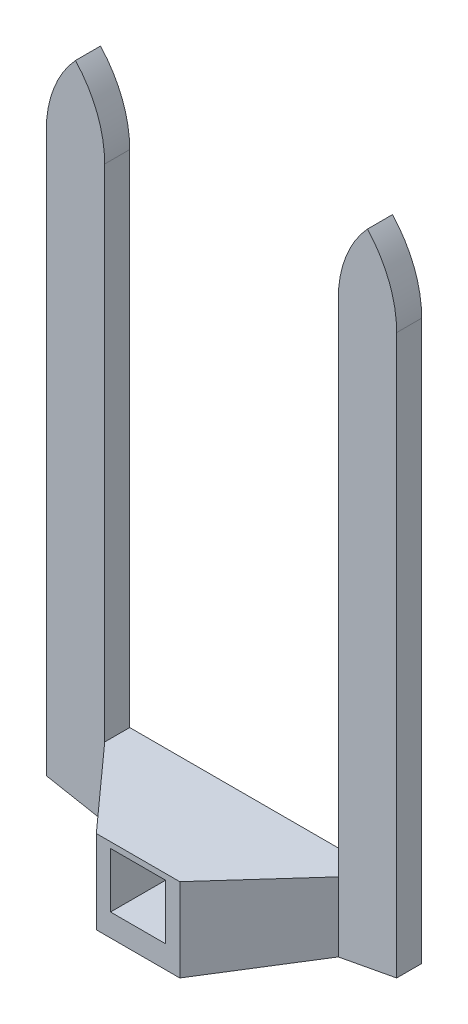
ISO-10303-21;
HEADER;
FILE_DESCRIPTION(('STEP AP214'),'2;1');
FILE_NAME('part.step','',(''),(''),'','','');
FILE_SCHEMA(('AUTOMOTIVE_DESIGN { 1 0 10303 214 1 1 1 1 }'));
ENDSEC;
DATA;
#1=APPLICATION_CONTEXT('core data for automotive mechanical design processes');
#2=APPLICATION_PROTOCOL_DEFINITION('international standard','automotive_design',2000,#1);
#3=PRODUCT_CONTEXT('',#1,'mechanical');
#4=PRODUCT('Part','Part','',(#3));
#5=PRODUCT_RELATED_PRODUCT_CATEGORY('part','',(#4));
#6=PRODUCT_DEFINITION_FORMATION('','',#4);
#7=PRODUCT_DEFINITION_CONTEXT('part definition',#1,'design');
#8=PRODUCT_DEFINITION('design','',#6,#7);
#9=PRODUCT_DEFINITION_SHAPE('','',#8);
#10=(LENGTH_UNIT() NAMED_UNIT(*) SI_UNIT(.MILLI.,.METRE.));
#11=(NAMED_UNIT(*) PLANE_ANGLE_UNIT() SI_UNIT($,.RADIAN.));
#12=(NAMED_UNIT(*) SI_UNIT($,.STERADIAN.) SOLID_ANGLE_UNIT());
#13=UNCERTAINTY_MEASURE_WITH_UNIT(LENGTH_MEASURE(1.E-05),#10,'distance_accuracy_value','');
#14=(GEOMETRIC_REPRESENTATION_CONTEXT(3) GLOBAL_UNCERTAINTY_ASSIGNED_CONTEXT((#13)) GLOBAL_UNIT_ASSIGNED_CONTEXT((#10,
#11,#12)) REPRESENTATION_CONTEXT('',''));
#15=CARTESIAN_POINT('',(0.,0.,0.));
#16=DIRECTION('',(0.,0.,1.));
#17=DIRECTION('',(1.,0.,0.));
#18=AXIS2_PLACEMENT_3D('',#15,#16,#17);
#19=CARTESIAN_POINT('',(27.3214285714285,338.403728499216,46.6064318781235));
#20=DIRECTION('',(0.,0.,-1.));
#21=DIRECTION('',(-1.,0.,0.));
#22=AXIS2_PLACEMENT_3D('',#19,#20,#21);
#23=PLANE('',#22);
#24=CARTESIAN_POINT('',(27.3214285714285,348.403728499216,46.6064318781235));
#25=DIRECTION('',(0.,0.,1.));
#26=DIRECTION('',(1.,0.,0.));
#27=AXIS2_PLACEMENT_3D('',#24,#25,#26);
#28=CIRCLE('',#27,13.3214285714285);
#29=CARTESIAN_POINT('',(14.,348.403728499216,46.6064318781235));
#30=VERTEX_POINT('',#29);
#31=CARTESIAN_POINT('',(17.5,357.403728499216,46.6064318781235));
#32=VERTEX_POINT('',#31);
#33=EDGE_CURVE('E205',#30,#32,#28,.F.);
#34=ORIENTED_EDGE('',*,*,#33,.F.);
#35=DIRECTION('',(0.,1.,0.));
#36=VECTOR('',#35,1.);
#37=CARTESIAN_POINT('',(14.,288.403728499216,46.6064318781235));
#38=LINE('',#37,#36);
#39=CARTESIAN_POINT('',(14.0000000000001,288.403728499216,46.6064318781235));
#40=VERTEX_POINT('',#39);
#41=EDGE_CURVE('E269',#40,#30,#38,.T.);
#42=ORIENTED_EDGE('',*,*,#41,.F.);
#43=DIRECTION('',(0.,-1.,0.));
#44=VECTOR('',#43,1.);
#45=CARTESIAN_POINT('',(14.0000000000001,338.403728499216,46.6064318781235));
#46=LINE('',#45,#44);
#47=CARTESIAN_POINT('',(14.0000000000001,280.091228499217,46.6064318781235));
#48=VERTEX_POINT('',#47);
#49=EDGE_CURVE('E246',#48,#40,#46,.F.);
#50=ORIENTED_EDGE('',*,*,#49,.F.);
#51=DIRECTION('',(-0.982872186934322,-0.184288535050185,0.));
#52=VECTOR('',#51,1.);
#53=CARTESIAN_POINT('',(21.,281.403728499217,46.6064318781235));
#54=LINE('',#53,#52);
#55=CARTESIAN_POINT('',(21.,281.403728499217,46.6064318781235));
#56=VERTEX_POINT('',#55);
#57=EDGE_CURVE('E258',#56,#48,#54,.T.);
#58=ORIENTED_EDGE('',*,*,#57,.F.);
#59=DIRECTION('',(0.,-1.,0.));
#60=VECTOR('',#59,1.);
#61=CARTESIAN_POINT('',(21.,338.403728499216,46.6064318781235));
#62=LINE('',#61,#60);
#63=CARTESIAN_POINT('',(21.,348.403728499216,46.6064318781235));
#64=VERTEX_POINT('',#63);
#65=EDGE_CURVE('E255',#64,#56,#62,.T.);
#66=ORIENTED_EDGE('',*,*,#65,.F.);
#67=CARTESIAN_POINT('',(7.67857142857152,348.403728499216,46.6064318781235));
#68=DIRECTION('',(0.,0.,1.));
#69=DIRECTION('',(1.,0.,0.));
#70=AXIS2_PLACEMENT_3D('',#67,#68,#69);
#71=CIRCLE('',#70,13.3214285714285);
#72=EDGE_CURVE('E201',#32,#64,#71,.F.);
#73=ORIENTED_EDGE('',*,*,#72,.F.);
#74=EDGE_LOOP('',(#34,#42,#50,#58,#66,#73));
#75=FACE_BOUND('',#74,.T.);
#76=ADVANCED_FACE('F34',(#75),#23,.F.);
#77=DIRECTION('',(0.,-1.,0.));
#78=VECTOR('',#77,1.);
#79=CARTESIAN_POINT('',(-14.,338.403728499216,46.6064318781235));
#80=LINE('',#79,#78);
#81=CARTESIAN_POINT('',(-14.,348.403728499216,46.6064318781235));
#82=VERTEX_POINT('',#81);
#83=CARTESIAN_POINT('',(-14.0000000000001,288.403728499216,46.6064318781235));
#84=VERTEX_POINT('',#83);
#85=EDGE_CURVE('E267',#82,#84,#80,.T.);
#86=ORIENTED_EDGE('',*,*,#85,.F.);
#87=CARTESIAN_POINT('',(-27.3214285714285,348.403728499216,46.6064318781235));
#88=DIRECTION('',(0.,0.,1.));
#89=DIRECTION('',(1.,0.,0.));
#90=AXIS2_PLACEMENT_3D('',#87,#88,#89);
#91=CIRCLE('',#90,13.3214285714285);
#92=CARTESIAN_POINT('',(-17.5,357.403728499216,46.6064318781235));
#93=VERTEX_POINT('',#92);
#94=EDGE_CURVE('E213',#82,#93,#91,.T.);
#95=ORIENTED_EDGE('',*,*,#94,.T.);
#96=CARTESIAN_POINT('',(-7.67857142857152,348.403728499216,46.6064318781235));
#97=DIRECTION('',(0.,0.,1.));
#98=DIRECTION('',(1.,0.,0.));
#99=AXIS2_PLACEMENT_3D('',#96,#97,#98);
#100=CIRCLE('',#99,13.3214285714285);
#101=CARTESIAN_POINT('',(-21.,348.403728499216,46.6064318781235));
#102=VERTEX_POINT('',#101);
#103=EDGE_CURVE('E223',#93,#102,#100,.T.);
#104=ORIENTED_EDGE('',*,*,#103,.T.);
#105=DIRECTION('',(0.,1.,0.));
#106=VECTOR('',#105,1.);
#107=CARTESIAN_POINT('',(-21.,281.403728499217,46.6064318781235));
#108=LINE('',#107,#106);
#109=CARTESIAN_POINT('',(-21.,281.403728499217,46.6064318781235));
#110=VERTEX_POINT('',#109);
#111=EDGE_CURVE('E265',#110,#102,#108,.T.);
#112=ORIENTED_EDGE('',*,*,#111,.F.);
#113=DIRECTION('',(-0.982872186934322,0.184288535050185,0.));
#114=VECTOR('',#113,1.);
#115=CARTESIAN_POINT('',(-5.,278.403728499217,46.6064318781235));
#116=LINE('',#115,#114);
#117=CARTESIAN_POINT('',(-14.0000000000001,280.091228499217,46.6064318781235));
#118=VERTEX_POINT('',#117);
#119=EDGE_CURVE('E262',#118,#110,#116,.T.);
#120=ORIENTED_EDGE('',*,*,#119,.F.);
#121=DIRECTION('',(0.,1.,0.));
#122=VECTOR('',#121,1.);
#123=CARTESIAN_POINT('',(-14.0000000000001,338.403728499216,46.6064318781235));
#124=LINE('',#123,#122);
#125=EDGE_CURVE('E241',#84,#118,#124,.F.);
#126=ORIENTED_EDGE('',*,*,#125,.F.);
#127=EDGE_LOOP('',(#86,#95,#104,#112,#120,#126));
#128=FACE_BOUND('',#127,.T.);
#129=ADVANCED_FACE('F348',(#128),#23,.F.);
#130=CARTESIAN_POINT('',(14.,288.403728499216,46.6064318781235));
#131=DIRECTION('',(-1.,0.,0.));
#132=DIRECTION('',(0.,0.,1.));
#133=AXIS2_PLACEMENT_3D('',#130,#131,#132);
#134=PLANE('',#133);
#135=DIRECTION('',(0.,1.,0.));
#136=VECTOR('',#135,1.);
#137=CARTESIAN_POINT('',(14.,288.403728499216,43.6064318781235));
#138=LINE('',#137,#136);
#139=CARTESIAN_POINT('',(14.,288.403728499216,43.6064318781235));
#140=VERTEX_POINT('',#139);
#141=CARTESIAN_POINT('',(14.,348.403728499216,43.6064318781235));
#142=VERTEX_POINT('',#141);
#143=EDGE_CURVE('E259',#140,#142,#138,.T.);
#144=ORIENTED_EDGE('',*,*,#143,.F.);
#145=DIRECTION('',(0.,0.,-1.));
#146=VECTOR('',#145,1.);
#147=CARTESIAN_POINT('',(14.,288.403728499216,46.6064318781235));
#148=LINE('',#147,#146);
#149=EDGE_CURVE('E294',#40,#140,#148,.T.);
#150=ORIENTED_EDGE('',*,*,#149,.F.);
#151=ORIENTED_EDGE('',*,*,#41,.T.);
#152=DIRECTION('',(0.,0.,1.));
#153=VECTOR('',#152,1.);
#154=CARTESIAN_POINT('',(14.,348.403728499216,43.6064318781235));
#155=LINE('',#154,#153);
#156=EDGE_CURVE('E204',#142,#30,#155,.T.);
#157=ORIENTED_EDGE('',*,*,#156,.F.);
#158=EDGE_LOOP('',(#144,#150,#151,#157));
#159=FACE_BOUND('',#158,.T.);
#160=ADVANCED_FACE('F341',(#159),#134,.T.);
#161=CARTESIAN_POINT('',(-14.,288.403728499216,46.6064318781235));
#162=DIRECTION('',(0.,1.,0.));
#163=DIRECTION('',(0.,0.,1.));
#164=AXIS2_PLACEMENT_3D('',#161,#162,#163);
#165=PLANE('',#164);
#166=DIRECTION('',(1.,0.,0.));
#167=VECTOR('',#166,1.);
#168=CARTESIAN_POINT('',(-14.,288.403728499216,43.6064318781235));
#169=LINE('',#168,#167);
#170=CARTESIAN_POINT('',(-14.,288.403728499216,43.6064318781235));
#171=VERTEX_POINT('',#170);
#172=EDGE_CURVE('E290',#171,#140,#169,.T.);
#173=ORIENTED_EDGE('',*,*,#172,.F.);
#174=DIRECTION('',(0.,0.,-1.));
#175=VECTOR('',#174,1.);
#176=CARTESIAN_POINT('',(-14.,288.403728499216,46.6064318781235));
#177=LINE('',#176,#175);
#178=EDGE_CURVE('E296',#84,#171,#177,.T.);
#179=ORIENTED_EDGE('',*,*,#178,.F.);
#180=DIRECTION('',(0.668964731622453,0.,0.743294146247164));
#181=VECTOR('',#180,1.);
#182=CARTESIAN_POINT('',(-14.,288.403728499216,46.6064318781235));
#183=LINE('',#182,#181);
#184=CARTESIAN_POINT('',(-5.,288.403728499216,56.6064318781235));
#185=VERTEX_POINT('',#184);
#186=EDGE_CURVE('E276',#185,#84,#183,.F.);
#187=ORIENTED_EDGE('',*,*,#186,.F.);
#188=DIRECTION('',(-1.,0.,0.));
#189=VECTOR('',#188,1.);
#190=CARTESIAN_POINT('',(-5.,288.403728499216,56.6064318781235));
#191=LINE('',#190,#189);
#192=CARTESIAN_POINT('',(5.,288.403728499216,56.6064318781235));
#193=VERTEX_POINT('',#192);
#194=EDGE_CURVE('E242',#193,#185,#191,.T.);
#195=ORIENTED_EDGE('',*,*,#194,.F.);
#196=DIRECTION('',(-0.668964731622453,0.,0.743294146247164));
#197=VECTOR('',#196,1.);
#198=CARTESIAN_POINT('',(5.,288.403728499216,56.6064318781235));
#199=LINE('',#198,#197);
#200=EDGE_CURVE('E254',#193,#40,#199,.F.);
#201=ORIENTED_EDGE('',*,*,#200,.T.);
#202=ORIENTED_EDGE('',*,*,#149,.T.);
#203=EDGE_LOOP('',(#173,#179,#187,#195,#201,#202));
#204=FACE_BOUND('',#203,.T.);
#205=ADVANCED_FACE('F318',(#204),#165,.T.);
#206=CARTESIAN_POINT('',(-14.,338.403728499216,46.6064318781235));
#207=DIRECTION('',(1.,0.,0.));
#208=DIRECTION('',(0.,0.,-1.));
#209=AXIS2_PLACEMENT_3D('',#206,#207,#208);
#210=PLANE('',#209);
#211=DIRECTION('',(0.,-1.,0.));
#212=VECTOR('',#211,1.);
#213=CARTESIAN_POINT('',(-14.,338.403728499216,43.6064318781235));
#214=LINE('',#213,#212);
#215=CARTESIAN_POINT('',(-14.,348.403728499216,43.6064318781235));
#216=VERTEX_POINT('',#215);
#217=EDGE_CURVE('E287',#216,#171,#214,.T.);
#218=ORIENTED_EDGE('',*,*,#217,.F.);
#219=DIRECTION('',(0.,0.,1.));
#220=VECTOR('',#219,1.);
#221=CARTESIAN_POINT('',(-14.,348.403728499216,43.6064318781235));
#222=LINE('',#221,#220);
#223=EDGE_CURVE('E226',#216,#82,#222,.T.);
#224=ORIENTED_EDGE('',*,*,#223,.T.);
#225=ORIENTED_EDGE('',*,*,#85,.T.);
#226=ORIENTED_EDGE('',*,*,#178,.T.);
#227=EDGE_LOOP('',(#218,#224,#225,#226));
#228=FACE_BOUND('',#227,.T.);
#229=ADVANCED_FACE('F374',(#228),#210,.T.);
#230=CARTESIAN_POINT('',(-21.,281.403728499217,46.6064318781235));
#231=DIRECTION('',(-1.,0.,0.));
#232=DIRECTION('',(0.,0.,1.));
#233=AXIS2_PLACEMENT_3D('',#230,#231,#232);
#234=PLANE('',#233);
#235=DIRECTION('',(0.,1.,0.));
#236=VECTOR('',#235,1.);
#237=CARTESIAN_POINT('',(-21.,281.403728499217,43.6064318781235));
#238=LINE('',#237,#236);
#239=CARTESIAN_POINT('',(-21.,281.403728499217,43.6064318781235));
#240=VERTEX_POINT('',#239);
#241=CARTESIAN_POINT('',(-21.,348.403728499216,43.6064318781235));
#242=VERTEX_POINT('',#241);
#243=EDGE_CURVE('E285',#240,#242,#238,.T.);
#244=ORIENTED_EDGE('',*,*,#243,.F.);
#245=DIRECTION('',(0.,0.,-1.));
#246=VECTOR('',#245,1.);
#247=CARTESIAN_POINT('',(-21.,281.403728499217,46.6064318781235));
#248=LINE('',#247,#246);
#249=EDGE_CURVE('E298',#110,#240,#248,.T.);
#250=ORIENTED_EDGE('',*,*,#249,.F.);
#251=ORIENTED_EDGE('',*,*,#111,.T.);
#252=DIRECTION('',(0.,0.,1.));
#253=VECTOR('',#252,1.);
#254=CARTESIAN_POINT('',(-21.,348.403728499216,43.6064318781235));
#255=LINE('',#254,#253);
#256=EDGE_CURVE('E231',#242,#102,#255,.T.);
#257=ORIENTED_EDGE('',*,*,#256,.F.);
#258=EDGE_LOOP('',(#244,#250,#251,#257));
#259=FACE_BOUND('',#258,.T.);
#260=ADVANCED_FACE('F366',(#259),#234,.T.);
#261=CARTESIAN_POINT('',(-5.,278.403728499217,46.6064318781235));
#262=DIRECTION('',(-0.184288535050185,-0.982872186934322,0.));
#263=DIRECTION('',(0.982872186934322,-0.184288535050185,0.));
#264=AXIS2_PLACEMENT_3D('',#261,#262,#263);
#265=PLANE('',#264);
#266=DIRECTION('',(-0.982872186934322,0.184288535050185,0.));
#267=VECTOR('',#266,1.);
#268=CARTESIAN_POINT('',(-5.,278.403728499217,43.6064318781235));
#269=LINE('',#268,#267);
#270=CARTESIAN_POINT('',(-5.,278.403728499217,43.6064318781235));
#271=VERTEX_POINT('',#270);
#272=EDGE_CURVE('E282',#271,#240,#269,.T.);
#273=ORIENTED_EDGE('',*,*,#272,.F.);
#274=DIRECTION('',(0.,0.,-1.));
#275=VECTOR('',#274,1.);
#276=CARTESIAN_POINT('',(-5.,278.403728499217,46.6064318781235));
#277=LINE('',#276,#275);
#278=CARTESIAN_POINT('',(-5.,278.403728499217,56.6064318781235));
#279=VERTEX_POINT('',#278);
#280=EDGE_CURVE('E300',#279,#271,#277,.T.);
#281=ORIENTED_EDGE('',*,*,#280,.F.);
#282=DIRECTION('',(-0.66376364286523,0.124455683037231,-0.737515158739138));
#283=VECTOR('',#282,1.);
#284=CARTESIAN_POINT('',(-9.89535748433019,279.321608027529,51.1671457844233));
#285=LINE('',#284,#283);
#286=EDGE_CURVE('E43',#118,#279,#285,.F.);
#287=ORIENTED_EDGE('',*,*,#286,.F.);
#288=ORIENTED_EDGE('',*,*,#119,.T.);
#289=ORIENTED_EDGE('',*,*,#249,.T.);
#290=EDGE_LOOP('',(#273,#281,#287,#288,#289));
#291=FACE_BOUND('',#290,.T.);
#292=ADVANCED_FACE('F364',(#291),#265,.T.);
#293=CARTESIAN_POINT('',(5.,278.403728499217,46.6064318781235));
#294=DIRECTION('',(0.,-1.,0.));
#295=DIRECTION('',(0.,0.,-1.));
#296=AXIS2_PLACEMENT_3D('',#293,#294,#295);
#297=PLANE('',#296);
#298=CARTESIAN_POINT('',(0.,278.403728499217,50.1064318781235));
#299=DIRECTION('',(0.,1.,0.));
#300=DIRECTION('',(0.,0.,1.));
#301=AXIS2_PLACEMENT_3D('',#298,#299,#300);
#302=CIRCLE('',#301,1.89999999999999);
#303=CARTESIAN_POINT('',(0.,278.403728499217,52.0064318781235));
#304=VERTEX_POINT('',#303);
#305=EDGE_CURVE('E234',#304,#304,#302,.T.);
#306=ORIENTED_EDGE('',*,*,#305,.T.);
#307=EDGE_LOOP('',(#306));
#308=FACE_BOUND('',#307,.T.);
#309=DIRECTION('',(-1.,0.,0.));
#310=VECTOR('',#309,1.);
#311=CARTESIAN_POINT('',(5.,278.403728499217,43.6064318781235));
#312=LINE('',#311,#310);
#313=CARTESIAN_POINT('',(5.,278.403728499217,43.6064318781235));
#314=VERTEX_POINT('',#313);
#315=EDGE_CURVE('E279',#314,#271,#312,.T.);
#316=ORIENTED_EDGE('',*,*,#315,.F.);
#317=DIRECTION('',(0.,0.,-1.));
#318=VECTOR('',#317,1.);
#319=CARTESIAN_POINT('',(5.,278.403728499217,46.6064318781235));
#320=LINE('',#319,#318);
#321=CARTESIAN_POINT('',(5.,278.403728499217,56.6064318781235));
#322=VERTEX_POINT('',#321);
#323=EDGE_CURVE('E302',#322,#314,#320,.T.);
#324=ORIENTED_EDGE('',*,*,#323,.F.);
#325=DIRECTION('',(1.,0.,0.));
#326=VECTOR('',#325,1.);
#327=CARTESIAN_POINT('',(5.,278.403728499217,56.6064318781235));
#328=LINE('',#327,#326);
#329=EDGE_CURVE('E249',#279,#322,#328,.T.);
#330=ORIENTED_EDGE('',*,*,#329,.F.);
#331=ORIENTED_EDGE('',*,*,#280,.T.);
#332=EDGE_LOOP('',(#316,#324,#330,#331));
#333=FACE_BOUND('',#332,.T.);
#334=ADVANCED_FACE('F358',(#308,#333),#297,.T.);
#335=CARTESIAN_POINT('',(21.,281.403728499217,46.6064318781235));
#336=DIRECTION('',(0.184288535050185,-0.982872186934322,0.));
#337=DIRECTION('',(0.982872186934322,0.184288535050185,0.));
#338=AXIS2_PLACEMENT_3D('',#335,#336,#337);
#339=PLANE('',#338);
#340=DIRECTION('',(-0.982872186934322,-0.184288535050185,0.));
#341=VECTOR('',#340,1.);
#342=CARTESIAN_POINT('',(21.,281.403728499217,43.6064318781235));
#343=LINE('',#342,#341);
#344=CARTESIAN_POINT('',(21.,281.403728499217,43.6064318781235));
#345=VERTEX_POINT('',#344);
#346=EDGE_CURVE('E275',#345,#314,#343,.T.);
#347=ORIENTED_EDGE('',*,*,#346,.F.);
#348=DIRECTION('',(0.,0.,-1.));
#349=VECTOR('',#348,1.);
#350=CARTESIAN_POINT('',(21.,281.403728499217,46.6064318781235));
#351=LINE('',#350,#349);
#352=EDGE_CURVE('E271',#56,#345,#351,.T.);
#353=ORIENTED_EDGE('',*,*,#352,.F.);
#354=ORIENTED_EDGE('',*,*,#57,.T.);
#355=DIRECTION('',(0.66376364286523,0.124455683037231,-0.737515158739138));
#356=VECTOR('',#355,1.);
#357=CARTESIAN_POINT('',(5.82609157548064,278.55862066962,55.6885523498117));
#358=LINE('',#357,#356);
#359=EDGE_CURVE('E11',#48,#322,#358,.F.);
#360=ORIENTED_EDGE('',*,*,#359,.T.);
#361=ORIENTED_EDGE('',*,*,#323,.T.);
#362=EDGE_LOOP('',(#347,#353,#354,#360,#361));
#363=FACE_BOUND('',#362,.T.);
#364=ADVANCED_FACE('F328',(#363),#339,.T.);
#365=CARTESIAN_POINT('',(21.,338.403728499216,46.6064318781235));
#366=DIRECTION('',(1.,0.,0.));
#367=DIRECTION('',(0.,0.,-1.));
#368=AXIS2_PLACEMENT_3D('',#365,#366,#367);
#369=PLANE('',#368);
#370=DIRECTION('',(0.,-1.,0.));
#371=VECTOR('',#370,1.);
#372=CARTESIAN_POINT('',(21.,338.403728499216,43.6064318781235));
#373=LINE('',#372,#371);
#374=CARTESIAN_POINT('',(21.,348.403728499216,43.6064318781235));
#375=VERTEX_POINT('',#374);
#376=EDGE_CURVE('E272',#375,#345,#373,.T.);
#377=ORIENTED_EDGE('',*,*,#376,.F.);
#378=DIRECTION('',(0.,0.,1.));
#379=VECTOR('',#378,1.);
#380=CARTESIAN_POINT('',(21.,348.403728499216,43.6064318781235));
#381=LINE('',#380,#379);
#382=EDGE_CURVE('E214',#375,#64,#381,.T.);
#383=ORIENTED_EDGE('',*,*,#382,.T.);
#384=ORIENTED_EDGE('',*,*,#65,.T.);
#385=ORIENTED_EDGE('',*,*,#352,.T.);
#386=EDGE_LOOP('',(#377,#383,#384,#385));
#387=FACE_BOUND('',#386,.T.);
#388=ADVANCED_FACE('F330',(#387),#369,.T.);
#389=CARTESIAN_POINT('',(27.3214285714285,338.403728499216,43.6064318781235));
#390=DIRECTION('',(0.,0.,-1.));
#391=DIRECTION('',(-1.,0.,0.));
#392=AXIS2_PLACEMENT_3D('',#389,#390,#391);
#393=PLANE('',#392);
#394=DIRECTION('',(0.,-1.,0.));
#395=VECTOR('',#394,1.);
#396=CARTESIAN_POINT('',(-3.3,287.703728499216,43.6064318781235));
#397=LINE('',#396,#395);
#398=CARTESIAN_POINT('',(-3.3,287.703728499216,43.6064318781235));
#399=VERTEX_POINT('',#398);
#400=CARTESIAN_POINT('',(-3.3,281.103728499217,43.6064318781235));
#401=VERTEX_POINT('',#400);
#402=EDGE_CURVE('E162',#399,#401,#397,.T.);
#403=ORIENTED_EDGE('',*,*,#402,.T.);
#404=DIRECTION('',(1.,0.,0.));
#405=VECTOR('',#404,1.);
#406=CARTESIAN_POINT('',(-3.3,281.103728499217,43.6064318781235));
#407=LINE('',#406,#405);
#408=CARTESIAN_POINT('',(3.3,281.103728499217,43.6064318781235));
#409=VERTEX_POINT('',#408);
#410=EDGE_CURVE('E171',#401,#409,#407,.T.);
#411=ORIENTED_EDGE('',*,*,#410,.T.);
#412=DIRECTION('',(0.,1.,0.));
#413=VECTOR('',#412,1.);
#414=CARTESIAN_POINT('',(3.3,287.703728499216,43.6064318781235));
#415=LINE('',#414,#413);
#416=CARTESIAN_POINT('',(3.3,287.703728499216,43.6064318781235));
#417=VERTEX_POINT('',#416);
#418=EDGE_CURVE('E50',#409,#417,#415,.T.);
#419=ORIENTED_EDGE('',*,*,#418,.T.);
#420=DIRECTION('',(-1.,0.,0.));
#421=VECTOR('',#420,1.);
#422=CARTESIAN_POINT('',(-3.3,287.703728499216,43.6064318781235));
#423=LINE('',#422,#421);
#424=EDGE_CURVE('E168',#417,#399,#423,.T.);
#425=ORIENTED_EDGE('',*,*,#424,.T.);
#426=EDGE_LOOP('',(#403,#411,#419,#425));
#427=FACE_BOUND('',#426,.T.);
#428=CARTESIAN_POINT('',(7.67857142857152,348.403728499216,43.6064318781235));
#429=DIRECTION('',(0.,0.,1.));
#430=DIRECTION('',(1.,0.,0.));
#431=AXIS2_PLACEMENT_3D('',#428,#429,#430);
#432=CIRCLE('',#431,13.3214285714285);
#433=CARTESIAN_POINT('',(17.5,357.403728499216,43.6064318781235));
#434=VERTEX_POINT('',#433);
#435=EDGE_CURVE('E200',#434,#375,#432,.F.);
#436=ORIENTED_EDGE('',*,*,#435,.T.);
#437=ORIENTED_EDGE('',*,*,#376,.T.);
#438=ORIENTED_EDGE('',*,*,#346,.T.);
#439=ORIENTED_EDGE('',*,*,#315,.T.);
#440=ORIENTED_EDGE('',*,*,#272,.T.);
#441=ORIENTED_EDGE('',*,*,#243,.T.);
#442=CARTESIAN_POINT('',(-7.67857142857152,348.403728499216,43.6064318781235));
#443=DIRECTION('',(0.,0.,1.));
#444=DIRECTION('',(1.,0.,0.));
#445=AXIS2_PLACEMENT_3D('',#442,#443,#444);
#446=CIRCLE('',#445,13.3214285714285);
#447=CARTESIAN_POINT('',(-17.5,357.403728499216,43.6064318781235));
#448=VERTEX_POINT('',#447);
#449=EDGE_CURVE('E222',#448,#242,#446,.T.);
#450=ORIENTED_EDGE('',*,*,#449,.F.);
#451=CARTESIAN_POINT('',(-27.3214285714285,348.403728499216,43.6064318781235));
#452=DIRECTION('',(0.,0.,1.));
#453=DIRECTION('',(1.,0.,0.));
#454=AXIS2_PLACEMENT_3D('',#451,#452,#453);
#455=CIRCLE('',#454,13.3214285714285);
#456=EDGE_CURVE('E219',#216,#448,#455,.T.);
#457=ORIENTED_EDGE('',*,*,#456,.F.);
#458=ORIENTED_EDGE('',*,*,#217,.T.);
#459=ORIENTED_EDGE('',*,*,#172,.T.);
#460=ORIENTED_EDGE('',*,*,#143,.T.);
#461=CARTESIAN_POINT('',(27.3214285714285,348.403728499216,43.6064318781235));
#462=DIRECTION('',(0.,0.,1.));
#463=DIRECTION('',(1.,0.,0.));
#464=AXIS2_PLACEMENT_3D('',#461,#462,#463);
#465=CIRCLE('',#464,13.3214285714285);
#466=EDGE_CURVE('E197',#142,#434,#465,.F.);
#467=ORIENTED_EDGE('',*,*,#466,.T.);
#468=EDGE_LOOP('',(#436,#437,#438,#439,#440,#441,#450,#457,#458,#459,#460,#467));
#469=FACE_BOUND('',#468,.T.);
#470=ADVANCED_FACE('F176',(#427,#469),#393,.T.);
#471=CARTESIAN_POINT('',(-5.,278.403728499217,56.6064318781235));
#472=DIRECTION('',(-0.743294146247164,0.,0.668964731622453));
#473=DIRECTION('',(0.668964731622453,0.,0.743294146247164));
#474=AXIS2_PLACEMENT_3D('',#471,#472,#473);
#475=PLANE('',#474);
#476=ORIENTED_EDGE('',*,*,#125,.T.);
#477=ORIENTED_EDGE('',*,*,#286,.T.);
#478=DIRECTION('',(0.,-1.,0.));
#479=VECTOR('',#478,1.);
#480=CARTESIAN_POINT('',(-5.,278.403728499217,56.6064318781235));
#481=LINE('',#480,#479);
#482=EDGE_CURVE('E245',#185,#279,#481,.T.);
#483=ORIENTED_EDGE('',*,*,#482,.F.);
#484=ORIENTED_EDGE('',*,*,#186,.T.);
#485=EDGE_LOOP('',(#476,#477,#483,#484));
#486=FACE_BOUND('',#485,.T.);
#487=ADVANCED_FACE('F351',(#486),#475,.T.);
#488=CARTESIAN_POINT('',(5.,288.403728499216,56.6064318781235));
#489=DIRECTION('',(0.743294146247164,0.,0.668964731622453));
#490=DIRECTION('',(0.668964731622453,0.,-0.743294146247164));
#491=AXIS2_PLACEMENT_3D('',#488,#489,#490);
#492=PLANE('',#491);
#493=ORIENTED_EDGE('',*,*,#49,.T.);
#494=ORIENTED_EDGE('',*,*,#200,.F.);
#495=DIRECTION('',(0.,1.,0.));
#496=VECTOR('',#495,1.);
#497=CARTESIAN_POINT('',(5.,288.403728499216,56.6064318781235));
#498=LINE('',#497,#496);
#499=EDGE_CURVE('E252',#322,#193,#498,.T.);
#500=ORIENTED_EDGE('',*,*,#499,.F.);
#501=ORIENTED_EDGE('',*,*,#359,.F.);
#502=EDGE_LOOP('',(#493,#494,#500,#501));
#503=FACE_BOUND('',#502,.T.);
#504=ADVANCED_FACE('F36',(#503),#492,.T.);
#505=CARTESIAN_POINT('',(0.,0.,56.6064318781235));
#506=DIRECTION('',(0.,0.,-1.));
#507=DIRECTION('',(-1.,0.,0.));
#508=AXIS2_PLACEMENT_3D('',#505,#506,#507);
#509=PLANE('',#508);
#510=DIRECTION('',(1.,0.,0.));
#511=VECTOR('',#510,1.);
#512=CARTESIAN_POINT('',(-3.3,281.103728499217,56.6064318781235));
#513=LINE('',#512,#511);
#514=CARTESIAN_POINT('',(-3.3,281.103728499217,56.6064318781235));
#515=VERTEX_POINT('',#514);
#516=CARTESIAN_POINT('',(3.3,281.103728499217,56.6064318781235));
#517=VERTEX_POINT('',#516);
#518=EDGE_CURVE('E188',#515,#517,#513,.T.);
#519=ORIENTED_EDGE('',*,*,#518,.F.);
#520=DIRECTION('',(0.,-1.,0.));
#521=VECTOR('',#520,1.);
#522=CARTESIAN_POINT('',(-3.3,287.703728499216,56.6064318781235));
#523=LINE('',#522,#521);
#524=CARTESIAN_POINT('',(-3.3,287.703728499216,56.6064318781235));
#525=VERTEX_POINT('',#524);
#526=EDGE_CURVE('E58',#525,#515,#523,.T.);
#527=ORIENTED_EDGE('',*,*,#526,.F.);
#528=DIRECTION('',(-1.,0.,0.));
#529=VECTOR('',#528,1.);
#530=CARTESIAN_POINT('',(-3.3,287.703728499216,56.6064318781235));
#531=LINE('',#530,#529);
#532=CARTESIAN_POINT('',(3.3,287.703728499216,56.6064318781235));
#533=VERTEX_POINT('',#532);
#534=EDGE_CURVE('E179',#533,#525,#531,.T.);
#535=ORIENTED_EDGE('',*,*,#534,.F.);
#536=DIRECTION('',(0.,1.,0.));
#537=VECTOR('',#536,1.);
#538=CARTESIAN_POINT('',(3.3,287.703728499216,56.6064318781235));
#539=LINE('',#538,#537);
#540=EDGE_CURVE('E182',#517,#533,#539,.T.);
#541=ORIENTED_EDGE('',*,*,#540,.F.);
#542=EDGE_LOOP('',(#519,#527,#535,#541));
#543=FACE_BOUND('',#542,.T.);
#544=ORIENTED_EDGE('',*,*,#194,.T.);
#545=ORIENTED_EDGE('',*,*,#482,.T.);
#546=ORIENTED_EDGE('',*,*,#329,.T.);
#547=ORIENTED_EDGE('',*,*,#499,.T.);
#548=EDGE_LOOP('',(#544,#545,#546,#547));
#549=FACE_BOUND('',#548,.T.);
#550=ADVANCED_FACE('F354',(#543,#549),#509,.F.);
#551=CARTESIAN_POINT('',(0.,281.303728499217,50.1064318781235));
#552=DIRECTION('',(0.,1.,0.));
#553=DIRECTION('',(0.,0.,1.));
#554=AXIS2_PLACEMENT_3D('',#551,#552,#553);
#555=CYLINDRICAL_SURFACE('',#554,1.89999999999999);
#556=CARTESIAN_POINT('',(0.,281.103728499217,50.1064318781235));
#557=DIRECTION('',(0.,-1.,0.));
#558=DIRECTION('',(0.,0.,-1.));
#559=AXIS2_PLACEMENT_3D('',#556,#557,#558);
#560=CIRCLE('',#559,1.89999999999999);
#561=CARTESIAN_POINT('',(0.,281.103728499217,48.2064318781235));
#562=VERTEX_POINT('',#561);
#563=EDGE_CURVE('E38',#562,#562,#560,.F.);
#564=ORIENTED_EDGE('',*,*,#563,.T.);
#565=EDGE_LOOP('',(#564));
#566=FACE_BOUND('',#565,.T.);
#567=ORIENTED_EDGE('',*,*,#305,.F.);
#568=EDGE_LOOP('',(#567));
#569=FACE_BOUND('',#568,.T.);
#570=ADVANCED_FACE('F518',(#566,#569),#555,.F.);
#571=CARTESIAN_POINT('',(-7.67857142857152,348.403728499216,43.6064318781235));
#572=DIRECTION('',(0.,0.,1.));
#573=DIRECTION('',(1.,0.,0.));
#574=AXIS2_PLACEMENT_3D('',#571,#572,#573);
#575=CYLINDRICAL_SURFACE('',#574,13.3214285714285);
#576=ORIENTED_EDGE('',*,*,#103,.F.);
#577=DIRECTION('',(0.,0.,1.));
#578=VECTOR('',#577,1.);
#579=CARTESIAN_POINT('',(-17.5,357.403728499216,43.6064318781235));
#580=LINE('',#579,#578);
#581=EDGE_CURVE('E235',#448,#93,#580,.T.);
#582=ORIENTED_EDGE('',*,*,#581,.F.);
#583=ORIENTED_EDGE('',*,*,#449,.T.);
#584=ORIENTED_EDGE('',*,*,#256,.T.);
#585=EDGE_LOOP('',(#576,#582,#583,#584));
#586=FACE_BOUND('',#585,.T.);
#587=ADVANCED_FACE('F369',(#586),#575,.T.);
#588=CARTESIAN_POINT('',(-27.3214285714285,348.403728499216,43.6064318781235));
#589=DIRECTION('',(0.,0.,1.));
#590=DIRECTION('',(1.,0.,0.));
#591=AXIS2_PLACEMENT_3D('',#588,#589,#590);
#592=CYLINDRICAL_SURFACE('',#591,13.3214285714285);
#593=ORIENTED_EDGE('',*,*,#94,.F.);
#594=ORIENTED_EDGE('',*,*,#223,.F.);
#595=ORIENTED_EDGE('',*,*,#456,.T.);
#596=ORIENTED_EDGE('',*,*,#581,.T.);
#597=EDGE_LOOP('',(#593,#594,#595,#596));
#598=FACE_BOUND('',#597,.T.);
#599=ADVANCED_FACE('F373',(#598),#592,.T.);
#600=CARTESIAN_POINT('',(27.3214285714285,348.403728499216,43.6064318781235));
#601=DIRECTION('',(0.,0.,1.));
#602=DIRECTION('',(1.,0.,0.));
#603=AXIS2_PLACEMENT_3D('',#600,#601,#602);
#604=CYLINDRICAL_SURFACE('',#603,13.3214285714285);
#605=ORIENTED_EDGE('',*,*,#33,.T.);
#606=DIRECTION('',(0.,0.,1.));
#607=VECTOR('',#606,1.);
#608=CARTESIAN_POINT('',(17.5,357.403728499216,43.6064318781235));
#609=LINE('',#608,#607);
#610=EDGE_CURVE('E210',#434,#32,#609,.T.);
#611=ORIENTED_EDGE('',*,*,#610,.F.);
#612=ORIENTED_EDGE('',*,*,#466,.F.);
#613=ORIENTED_EDGE('',*,*,#156,.T.);
#614=EDGE_LOOP('',(#605,#611,#612,#613));
#615=FACE_BOUND('',#614,.T.);
#616=ADVANCED_FACE('F337',(#615),#604,.T.);
#617=CARTESIAN_POINT('',(7.67857142857152,348.403728499216,43.6064318781235));
#618=DIRECTION('',(0.,0.,1.));
#619=DIRECTION('',(1.,0.,0.));
#620=AXIS2_PLACEMENT_3D('',#617,#618,#619);
#621=CYLINDRICAL_SURFACE('',#620,13.3214285714285);
#622=ORIENTED_EDGE('',*,*,#72,.T.);
#623=ORIENTED_EDGE('',*,*,#382,.F.);
#624=ORIENTED_EDGE('',*,*,#435,.F.);
#625=ORIENTED_EDGE('',*,*,#610,.T.);
#626=EDGE_LOOP('',(#622,#623,#624,#625));
#627=FACE_BOUND('',#626,.T.);
#628=ADVANCED_FACE('F334',(#627),#621,.T.);
#629=CARTESIAN_POINT('',(-3.3,281.103728499217,43.6064318781235));
#630=DIRECTION('',(0.,-1.,0.));
#631=DIRECTION('',(0.,0.,-1.));
#632=AXIS2_PLACEMENT_3D('',#629,#630,#631);
#633=PLANE('',#632);
#634=ORIENTED_EDGE('',*,*,#518,.T.);
#635=DIRECTION('',(0.,0.,1.));
#636=VECTOR('',#635,1.);
#637=CARTESIAN_POINT('',(3.3,281.103728499217,43.6064318781235));
#638=LINE('',#637,#636);
#639=EDGE_CURVE('E167',#409,#517,#638,.T.);
#640=ORIENTED_EDGE('',*,*,#639,.F.);
#641=ORIENTED_EDGE('',*,*,#410,.F.);
#642=DIRECTION('',(0.,0.,1.));
#643=VECTOR('',#642,1.);
#644=CARTESIAN_POINT('',(-3.3,281.103728499217,43.6064318781235));
#645=LINE('',#644,#643);
#646=EDGE_CURVE('E158',#401,#515,#645,.T.);
#647=ORIENTED_EDGE('',*,*,#646,.T.);
#648=EDGE_LOOP('',(#634,#640,#641,#647));
#649=FACE_BOUND('',#648,.T.);
#650=ORIENTED_EDGE('',*,*,#563,.F.);
#651=EDGE_LOOP('',(#650));
#652=FACE_BOUND('',#651,.T.);
#653=ADVANCED_FACE('F172',(#649,#652),#633,.F.);
#654=CARTESIAN_POINT('',(-3.3,287.703728499216,43.6064318781235));
#655=DIRECTION('',(-1.,0.,0.));
#656=DIRECTION('',(0.,-1.,0.));
#657=AXIS2_PLACEMENT_3D('',#654,#655,#656);
#658=PLANE('',#657);
#659=ORIENTED_EDGE('',*,*,#526,.T.);
#660=ORIENTED_EDGE('',*,*,#646,.F.);
#661=ORIENTED_EDGE('',*,*,#402,.F.);
#662=DIRECTION('',(0.,0.,1.));
#663=VECTOR('',#662,1.);
#664=CARTESIAN_POINT('',(-3.3,287.703728499216,43.6064318781235));
#665=LINE('',#664,#663);
#666=EDGE_CURVE('E192',#399,#525,#665,.T.);
#667=ORIENTED_EDGE('',*,*,#666,.T.);
#668=EDGE_LOOP('',(#659,#660,#661,#667));
#669=FACE_BOUND('',#668,.T.);
#670=ADVANCED_FACE('F160',(#669),#658,.F.);
#671=CARTESIAN_POINT('',(-3.3,287.703728499216,43.6064318781235));
#672=DIRECTION('',(0.,1.,0.));
#673=DIRECTION('',(0.,0.,1.));
#674=AXIS2_PLACEMENT_3D('',#671,#672,#673);
#675=PLANE('',#674);
#676=ORIENTED_EDGE('',*,*,#534,.T.);
#677=ORIENTED_EDGE('',*,*,#666,.F.);
#678=ORIENTED_EDGE('',*,*,#424,.F.);
#679=DIRECTION('',(0.,0.,1.));
#680=VECTOR('',#679,1.);
#681=CARTESIAN_POINT('',(3.3,287.703728499216,43.6064318781235));
#682=LINE('',#681,#680);
#683=EDGE_CURVE('E194',#417,#533,#682,.T.);
#684=ORIENTED_EDGE('',*,*,#683,.T.);
#685=EDGE_LOOP('',(#676,#677,#678,#684));
#686=FACE_BOUND('',#685,.T.);
#687=ADVANCED_FACE('F554',(#686),#675,.F.);
#688=CARTESIAN_POINT('',(3.3,287.703728499216,43.6064318781235));
#689=DIRECTION('',(1.,0.,0.));
#690=DIRECTION('',(0.,1.,0.));
#691=AXIS2_PLACEMENT_3D('',#688,#689,#690);
#692=PLANE('',#691);
#693=ORIENTED_EDGE('',*,*,#540,.T.);
#694=ORIENTED_EDGE('',*,*,#683,.F.);
#695=ORIENTED_EDGE('',*,*,#418,.F.);
#696=ORIENTED_EDGE('',*,*,#639,.T.);
#697=EDGE_LOOP('',(#693,#694,#695,#696));
#698=FACE_BOUND('',#697,.T.);
#699=ADVANCED_FACE('F562',(#698),#692,.F.);
#700=CLOSED_SHELL('',(#76,#129,#160,#205,#229,#260,#292,#334,#364,#388,#470,#487,#504,#550,#570,
#587,#599,#616,#628,#653,#670,#687,#699));
#701=MANIFOLD_SOLID_BREP('B2',#700);
#702=ADVANCED_BREP_SHAPE_REPRESENTATION('',(#18,#701),#14);
#703=SHAPE_DEFINITION_REPRESENTATION(#9,#702);
ENDSEC;
END-ISO-10303-21;
